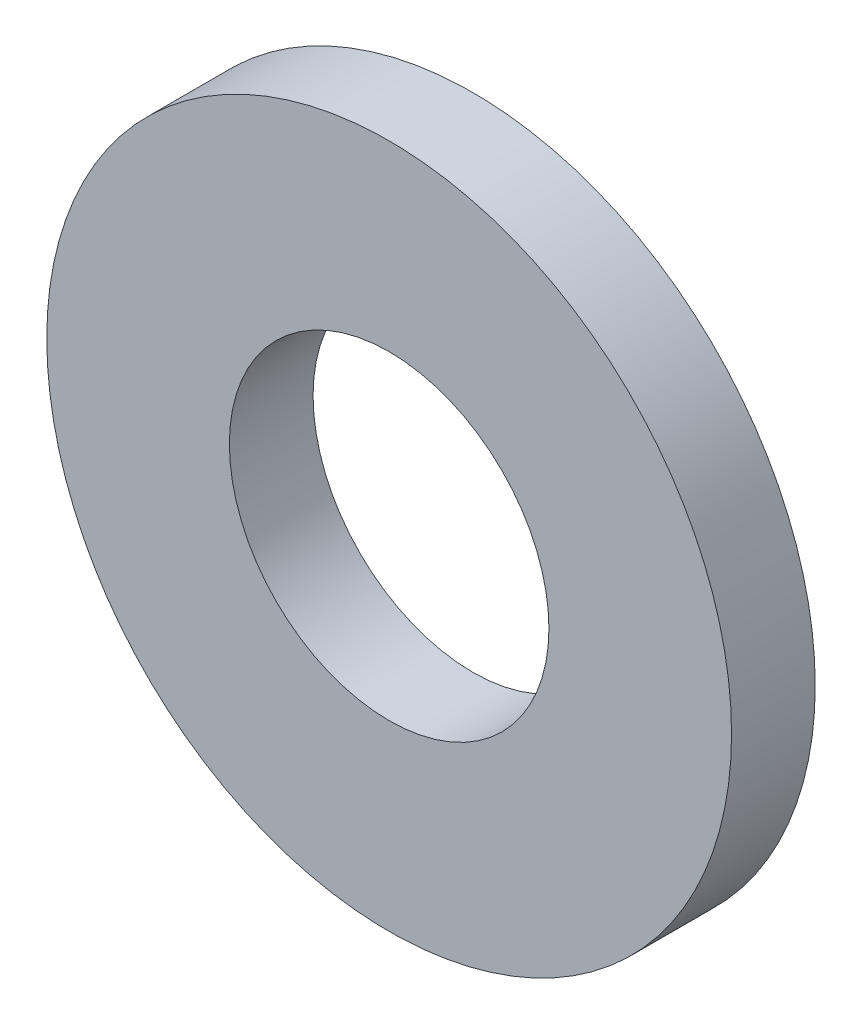
ISO-10303-21;
HEADER;
FILE_DESCRIPTION(('STEP AP214'),'2;1');
FILE_NAME('part.step','',(''),(''),'','','');
FILE_SCHEMA(('AUTOMOTIVE_DESIGN { 1 0 10303 214 1 1 1 1 }'));
ENDSEC;
DATA;
#1=APPLICATION_CONTEXT('core data for automotive mechanical design processes');
#2=APPLICATION_PROTOCOL_DEFINITION('international standard','automotive_design',2000,#1);
#3=PRODUCT_CONTEXT('',#1,'mechanical');
#4=PRODUCT('Part','Part','',(#3));
#5=PRODUCT_RELATED_PRODUCT_CATEGORY('part','',(#4));
#6=PRODUCT_DEFINITION_FORMATION('','',#4);
#7=PRODUCT_DEFINITION_CONTEXT('part definition',#1,'design');
#8=PRODUCT_DEFINITION('design','',#6,#7);
#9=PRODUCT_DEFINITION_SHAPE('','',#8);
#10=(LENGTH_UNIT() NAMED_UNIT(*) SI_UNIT(.MILLI.,.METRE.));
#11=(NAMED_UNIT(*) PLANE_ANGLE_UNIT() SI_UNIT($,.RADIAN.));
#12=(NAMED_UNIT(*) SI_UNIT($,.STERADIAN.) SOLID_ANGLE_UNIT());
#13=UNCERTAINTY_MEASURE_WITH_UNIT(LENGTH_MEASURE(1.E-05),#10,'distance_accuracy_value','');
#14=(GEOMETRIC_REPRESENTATION_CONTEXT(3) GLOBAL_UNCERTAINTY_ASSIGNED_CONTEXT((#13)) GLOBAL_UNIT_ASSIGNED_CONTEXT((#10,
#11,#12)) REPRESENTATION_CONTEXT('',''));
#15=CARTESIAN_POINT('',(0.,0.,0.));
#16=DIRECTION('',(0.,0.,1.));
#17=DIRECTION('',(1.,0.,0.));
#18=AXIS2_PLACEMENT_3D('',#15,#16,#17);
#19=CARTESIAN_POINT('',(0.,0.,0.));
#20=DIRECTION('',(0.,0.,1.));
#21=DIRECTION('',(1.,0.,0.));
#22=AXIS2_PLACEMENT_3D('',#19,#20,#21);
#23=PLANE('',#22);
#24=CARTESIAN_POINT('',(0.,0.,0.));
#25=DIRECTION('',(0.,0.,1.));
#26=DIRECTION('',(1.,0.,0.));
#27=AXIS2_PLACEMENT_3D('',#24,#25,#26);
#28=CIRCLE('',#27,4.19999999999999);
#29=CARTESIAN_POINT('',(4.19999999999999,0.,0.));
#30=VERTEX_POINT('',#29);
#31=EDGE_CURVE('E27',#30,#30,#28,.T.);
#32=ORIENTED_EDGE('',*,*,#31,.T.);
#33=EDGE_LOOP('',(#32));
#34=FACE_BOUND('',#33,.T.);
#35=CARTESIAN_POINT('',(0.,0.,0.));
#36=DIRECTION('',(0.,0.,1.));
#37=DIRECTION('',(1.,0.,0.));
#38=AXIS2_PLACEMENT_3D('',#35,#36,#37);
#39=CIRCLE('',#38,8.99999999999999);
#40=CARTESIAN_POINT('',(8.99999999999999,0.,0.));
#41=VERTEX_POINT('',#40);
#42=EDGE_CURVE('E18',#41,#41,#39,.T.);
#43=ORIENTED_EDGE('',*,*,#42,.F.);
#44=EDGE_LOOP('',(#43));
#45=FACE_BOUND('',#44,.T.);
#46=ADVANCED_FACE('F15',(#34,#45),#23,.F.);
#47=CARTESIAN_POINT('',(0.,0.,0.));
#48=DIRECTION('',(0.,0.,1.));
#49=DIRECTION('',(1.,0.,0.));
#50=AXIS2_PLACEMENT_3D('',#47,#48,#49);
#51=CYLINDRICAL_SURFACE('',#50,8.99999999999999);
#52=ORIENTED_EDGE('',*,*,#42,.T.);
#53=EDGE_LOOP('',(#52));
#54=FACE_BOUND('',#53,.T.);
#55=CARTESIAN_POINT('',(0.,0.,2.2));
#56=DIRECTION('',(0.,0.,1.));
#57=DIRECTION('',(1.,0.,0.));
#58=AXIS2_PLACEMENT_3D('',#55,#56,#57);
#59=CIRCLE('',#58,8.99999999999999);
#60=CARTESIAN_POINT('',(8.99999999999999,0.,2.2));
#61=VERTEX_POINT('',#60);
#62=EDGE_CURVE('E22',#61,#61,#59,.T.);
#63=ORIENTED_EDGE('',*,*,#62,.F.);
#64=EDGE_LOOP('',(#63));
#65=FACE_BOUND('',#64,.T.);
#66=ADVANCED_FACE('F35',(#54,#65),#51,.T.);
#67=CARTESIAN_POINT('',(0.,0.,0.));
#68=DIRECTION('',(0.,0.,1.));
#69=DIRECTION('',(1.,0.,0.));
#70=AXIS2_PLACEMENT_3D('',#67,#68,#69);
#71=CYLINDRICAL_SURFACE('',#70,4.19999999999999);
#72=ORIENTED_EDGE('',*,*,#31,.F.);
#73=EDGE_LOOP('',(#72));
#74=FACE_BOUND('',#73,.T.);
#75=CARTESIAN_POINT('',(0.,0.,2.2));
#76=DIRECTION('',(0.,0.,1.));
#77=DIRECTION('',(1.,0.,0.));
#78=AXIS2_PLACEMENT_3D('',#75,#76,#77);
#79=CIRCLE('',#78,4.19999999999999);
#80=CARTESIAN_POINT('',(4.19999999999999,0.,2.2));
#81=VERTEX_POINT('',#80);
#82=EDGE_CURVE('E10',#81,#81,#79,.F.);
#83=ORIENTED_EDGE('',*,*,#82,.F.);
#84=EDGE_LOOP('',(#83));
#85=FACE_BOUND('',#84,.T.);
#86=ADVANCED_FACE('F43',(#74,#85),#71,.F.);
#87=CARTESIAN_POINT('',(0.,0.,2.2));
#88=DIRECTION('',(0.,0.,1.));
#89=DIRECTION('',(1.,0.,0.));
#90=AXIS2_PLACEMENT_3D('',#87,#88,#89);
#91=PLANE('',#90);
#92=ORIENTED_EDGE('',*,*,#82,.T.);
#93=EDGE_LOOP('',(#92));
#94=FACE_BOUND('',#93,.T.);
#95=ORIENTED_EDGE('',*,*,#62,.T.);
#96=EDGE_LOOP('',(#95));
#97=FACE_BOUND('',#96,.T.);
#98=ADVANCED_FACE('F44',(#94,#97),#91,.T.);
#99=CLOSED_SHELL('',(#46,#66,#86,#98));
#100=MANIFOLD_SOLID_BREP('B1',#99);
#101=ADVANCED_BREP_SHAPE_REPRESENTATION('',(#18,#100),#14);
#102=SHAPE_DEFINITION_REPRESENTATION(#9,#101);
ENDSEC;
END-ISO-10303-21;
